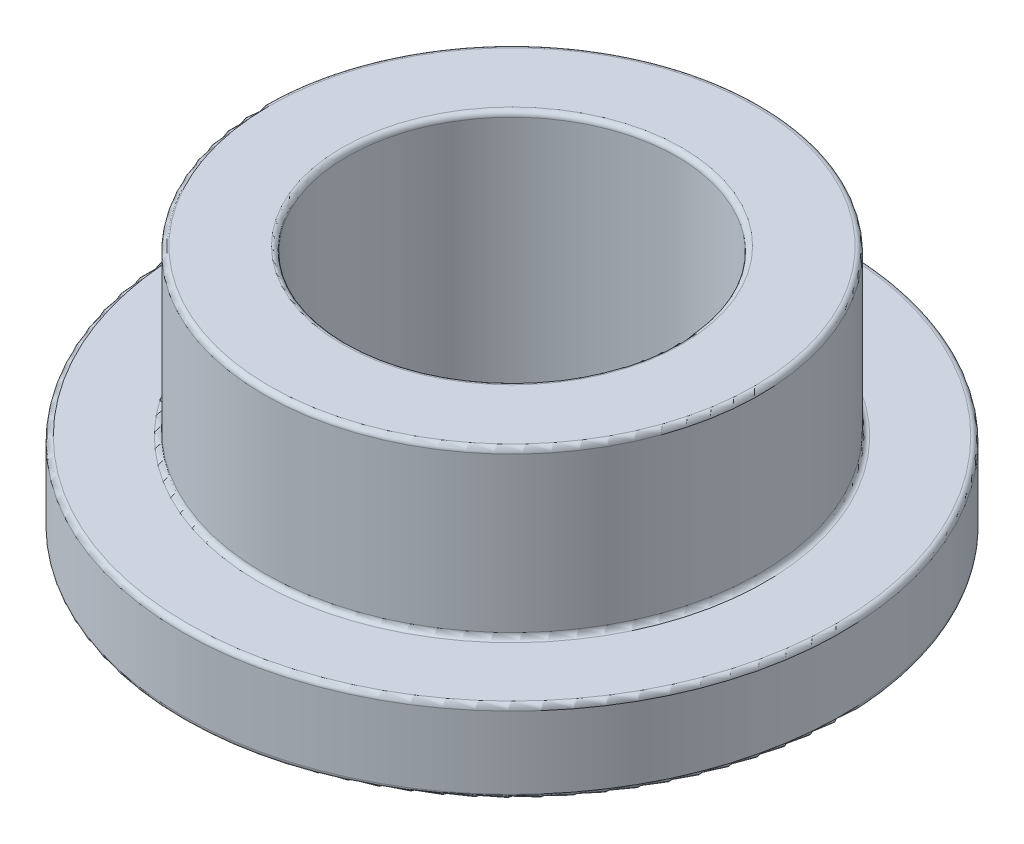
ISO-10303-21;
HEADER;
FILE_DESCRIPTION(('STEP AP214'),'2;1');
FILE_NAME('part.step','',(''),(''),'','','');
FILE_SCHEMA(('AUTOMOTIVE_DESIGN { 1 0 10303 214 1 1 1 1 }'));
ENDSEC;
DATA;
#1=APPLICATION_CONTEXT('core data for automotive mechanical design processes');
#2=APPLICATION_PROTOCOL_DEFINITION('international standard','automotive_design',2000,#1);
#3=PRODUCT_CONTEXT('',#1,'mechanical');
#4=PRODUCT('Part','Part','',(#3));
#5=PRODUCT_RELATED_PRODUCT_CATEGORY('part','',(#4));
#6=PRODUCT_DEFINITION_FORMATION('','',#4);
#7=PRODUCT_DEFINITION_CONTEXT('part definition',#1,'design');
#8=PRODUCT_DEFINITION('design','',#6,#7);
#9=PRODUCT_DEFINITION_SHAPE('','',#8);
#10=(LENGTH_UNIT() NAMED_UNIT(*) SI_UNIT(.MILLI.,.METRE.));
#11=(NAMED_UNIT(*) PLANE_ANGLE_UNIT() SI_UNIT($,.RADIAN.));
#12=(NAMED_UNIT(*) SI_UNIT($,.STERADIAN.) SOLID_ANGLE_UNIT());
#13=UNCERTAINTY_MEASURE_WITH_UNIT(LENGTH_MEASURE(1.E-05),#10,'distance_accuracy_value','');
#14=(GEOMETRIC_REPRESENTATION_CONTEXT(3) GLOBAL_UNCERTAINTY_ASSIGNED_CONTEXT((#13)) GLOBAL_UNIT_ASSIGNED_CONTEXT((#10,
#11,#12)) REPRESENTATION_CONTEXT('',''));
#15=CARTESIAN_POINT('',(0.,0.,0.));
#16=DIRECTION('',(0.,0.,1.));
#17=DIRECTION('',(1.,0.,0.));
#18=AXIS2_PLACEMENT_3D('',#15,#16,#17);
#19=CARTESIAN_POINT('',(0.,6.,0.));
#20=DIRECTION('',(0.,1.,0.));
#21=DIRECTION('',(0.,0.,1.));
#22=AXIS2_PLACEMENT_3D('',#19,#20,#21);
#23=PLANE('',#22);
#24=CARTESIAN_POINT('',(0.,6.,0.));
#25=DIRECTION('',(0.,1.,0.));
#26=DIRECTION('',(0.,0.,1.));
#27=AXIS2_PLACEMENT_3D('',#24,#25,#26);
#28=CIRCLE('',#27,4.13);
#29=CARTESIAN_POINT('',(0.,6.,4.13));
#30=VERTEX_POINT('',#29);
#31=EDGE_CURVE('E10',#30,#30,#28,.F.);
#32=ORIENTED_EDGE('',*,*,#31,.T.);
#33=EDGE_LOOP('',(#32));
#34=FACE_BOUND('',#33,.T.);
#35=CARTESIAN_POINT('',(0.,6.,0.));
#36=DIRECTION('',(0.,1.,0.));
#37=DIRECTION('',(0.,0.,1.));
#38=AXIS2_PLACEMENT_3D('',#35,#36,#37);
#39=CIRCLE('',#38,5.89);
#40=CARTESIAN_POINT('',(0.,6.,5.89));
#41=VERTEX_POINT('',#40);
#42=EDGE_CURVE('E39',#41,#41,#39,.T.);
#43=ORIENTED_EDGE('',*,*,#42,.T.);
#44=EDGE_LOOP('',(#43));
#45=FACE_BOUND('',#44,.T.);
#46=ADVANCED_FACE('F32',(#34,#45),#23,.T.);
#47=CARTESIAN_POINT('',(0.,0.,0.));
#48=DIRECTION('',(0.,1.,0.));
#49=DIRECTION('',(0.,0.,1.));
#50=AXIS2_PLACEMENT_3D('',#47,#48,#49);
#51=PLANE('',#50);
#52=CARTESIAN_POINT('',(0.,0.,0.));
#53=DIRECTION('',(0.,1.,0.));
#54=DIRECTION('',(0.,0.,1.));
#55=AXIS2_PLACEMENT_3D('',#52,#53,#54);
#56=CIRCLE('',#55,4.13);
#57=CARTESIAN_POINT('',(0.,0.,4.13));
#58=VERTEX_POINT('',#57);
#59=EDGE_CURVE('E70',#58,#58,#56,.T.);
#60=ORIENTED_EDGE('',*,*,#59,.T.);
#61=EDGE_LOOP('',(#60));
#62=FACE_BOUND('',#61,.T.);
#63=CARTESIAN_POINT('',(0.,0.,0.));
#64=DIRECTION('',(0.,1.,0.));
#65=DIRECTION('',(0.,0.,1.));
#66=AXIS2_PLACEMENT_3D('',#63,#64,#65);
#67=CIRCLE('',#66,7.875);
#68=CARTESIAN_POINT('',(0.,0.,7.875));
#69=VERTEX_POINT('',#68);
#70=EDGE_CURVE('E73',#69,#69,#67,.F.);
#71=ORIENTED_EDGE('',*,*,#70,.T.);
#72=EDGE_LOOP('',(#71));
#73=FACE_BOUND('',#72,.T.);
#74=ADVANCED_FACE('F77',(#62,#73),#51,.F.);
#75=CARTESIAN_POINT('',(0.,6.,0.));
#76=DIRECTION('',(0.,-1.,0.));
#77=DIRECTION('',(0.,0.,-1.));
#78=AXIS2_PLACEMENT_3D('',#75,#76,#77);
#79=CYLINDRICAL_SURFACE('',#78,6.015);
#80=CARTESIAN_POINT('',(0.,2.125,0.));
#81=DIRECTION('',(0.,1.,0.));
#82=DIRECTION('',(0.,0.,1.));
#83=AXIS2_PLACEMENT_3D('',#80,#81,#82);
#84=CIRCLE('',#83,6.015);
#85=CARTESIAN_POINT('',(0.,2.125,6.015));
#86=VERTEX_POINT('',#85);
#87=EDGE_CURVE('E52',#86,#86,#84,.T.);
#88=ORIENTED_EDGE('',*,*,#87,.T.);
#89=EDGE_LOOP('',(#88));
#90=FACE_BOUND('',#89,.T.);
#91=CARTESIAN_POINT('',(0.,5.875,0.));
#92=DIRECTION('',(0.,1.,0.));
#93=DIRECTION('',(0.,0.,1.));
#94=AXIS2_PLACEMENT_3D('',#91,#92,#93);
#95=CIRCLE('',#94,6.015);
#96=CARTESIAN_POINT('',(0.,5.875,6.015));
#97=VERTEX_POINT('',#96);
#98=EDGE_CURVE('E55',#97,#97,#95,.F.);
#99=ORIENTED_EDGE('',*,*,#98,.T.);
#100=EDGE_LOOP('',(#99));
#101=FACE_BOUND('',#100,.T.);
#102=ADVANCED_FACE('F108',(#90,#101),#79,.T.);
#103=CARTESIAN_POINT('',(0.,6.,0.));
#104=DIRECTION('',(0.,-1.,0.));
#105=DIRECTION('',(0.,0.,-1.));
#106=AXIS2_PLACEMENT_3D('',#103,#104,#105);
#107=CYLINDRICAL_SURFACE('',#106,4.005);
#108=CARTESIAN_POINT('',(0.,0.125,0.));
#109=DIRECTION('',(0.,1.,0.));
#110=DIRECTION('',(0.,0.,1.));
#111=AXIS2_PLACEMENT_3D('',#108,#109,#110);
#112=CIRCLE('',#111,4.005);
#113=CARTESIAN_POINT('',(0.,0.125,4.005));
#114=VERTEX_POINT('',#113);
#115=EDGE_CURVE('E64',#114,#114,#112,.F.);
#116=ORIENTED_EDGE('',*,*,#115,.T.);
#117=EDGE_LOOP('',(#116));
#118=FACE_BOUND('',#117,.T.);
#119=CARTESIAN_POINT('',(0.,5.875,0.));
#120=DIRECTION('',(0.,1.,0.));
#121=DIRECTION('',(0.,0.,1.));
#122=AXIS2_PLACEMENT_3D('',#119,#120,#121);
#123=CIRCLE('',#122,4.005);
#124=CARTESIAN_POINT('',(0.,5.875,4.005));
#125=VERTEX_POINT('',#124);
#126=EDGE_CURVE('E67',#125,#125,#123,.T.);
#127=ORIENTED_EDGE('',*,*,#126,.T.);
#128=EDGE_LOOP('',(#127));
#129=FACE_BOUND('',#128,.T.);
#130=ADVANCED_FACE('F102',(#118,#129),#107,.F.);
#131=CARTESIAN_POINT('',(0.,2.,0.));
#132=DIRECTION('',(0.,1.,0.));
#133=DIRECTION('',(0.,0.,1.));
#134=AXIS2_PLACEMENT_3D('',#131,#132,#133);
#135=PLANE('',#134);
#136=CARTESIAN_POINT('',(0.,2.,0.));
#137=DIRECTION('',(0.,1.,0.));
#138=DIRECTION('',(0.,0.,1.));
#139=AXIS2_PLACEMENT_3D('',#136,#137,#138);
#140=CIRCLE('',#139,6.14);
#141=CARTESIAN_POINT('',(0.,2.,6.14));
#142=VERTEX_POINT('',#141);
#143=EDGE_CURVE('E43',#142,#142,#140,.F.);
#144=ORIENTED_EDGE('',*,*,#143,.T.);
#145=EDGE_LOOP('',(#144));
#146=FACE_BOUND('',#145,.T.);
#147=CARTESIAN_POINT('',(0.,2.,0.));
#148=DIRECTION('',(0.,1.,0.));
#149=DIRECTION('',(0.,0.,1.));
#150=AXIS2_PLACEMENT_3D('',#147,#148,#149);
#151=CIRCLE('',#150,7.875);
#152=CARTESIAN_POINT('',(0.,2.,7.875));
#153=VERTEX_POINT('',#152);
#154=EDGE_CURVE('E47',#153,#153,#151,.T.);
#155=ORIENTED_EDGE('',*,*,#154,.T.);
#156=EDGE_LOOP('',(#155));
#157=FACE_BOUND('',#156,.T.);
#158=ADVANCED_FACE('F90',(#146,#157),#135,.T.);
#159=CARTESIAN_POINT('',(0.,2.,0.));
#160=DIRECTION('',(0.,-1.,0.));
#161=DIRECTION('',(0.,0.,-1.));
#162=AXIS2_PLACEMENT_3D('',#159,#160,#161);
#163=CYLINDRICAL_SURFACE('',#162,8.);
#164=CARTESIAN_POINT('',(0.,0.125,0.));
#165=DIRECTION('',(0.,1.,0.));
#166=DIRECTION('',(0.,0.,1.));
#167=AXIS2_PLACEMENT_3D('',#164,#165,#166);
#168=CIRCLE('',#167,8.);
#169=CARTESIAN_POINT('',(0.,0.125,8.));
#170=VERTEX_POINT('',#169);
#171=EDGE_CURVE('E58',#170,#170,#168,.T.);
#172=ORIENTED_EDGE('',*,*,#171,.T.);
#173=EDGE_LOOP('',(#172));
#174=FACE_BOUND('',#173,.T.);
#175=CARTESIAN_POINT('',(0.,1.875,0.));
#176=DIRECTION('',(0.,1.,0.));
#177=DIRECTION('',(0.,0.,1.));
#178=AXIS2_PLACEMENT_3D('',#175,#176,#177);
#179=CIRCLE('',#178,8.);
#180=CARTESIAN_POINT('',(0.,1.875,8.));
#181=VERTEX_POINT('',#180);
#182=EDGE_CURVE('E61',#181,#181,#179,.F.);
#183=ORIENTED_EDGE('',*,*,#182,.T.);
#184=EDGE_LOOP('',(#183));
#185=FACE_BOUND('',#184,.T.);
#186=ADVANCED_FACE('F87',(#174,#185),#163,.T.);
#187=CARTESIAN_POINT('',(0.,0.125,0.));
#188=DIRECTION('',(0.,1.,0.));
#189=DIRECTION('',(0.,0.,1.));
#190=AXIS2_PLACEMENT_3D('',#187,#188,#189);
#191=TOROIDAL_SURFACE('',#190,4.13,0.125);
#192=ORIENTED_EDGE('',*,*,#115,.F.);
#193=EDGE_LOOP('',(#192));
#194=FACE_BOUND('',#193,.T.);
#195=ORIENTED_EDGE('',*,*,#59,.F.);
#196=EDGE_LOOP('',(#195));
#197=FACE_BOUND('',#196,.T.);
#198=ADVANCED_FACE('F83',(#194,#197),#191,.T.);
#199=CARTESIAN_POINT('',(0.,0.125,0.));
#200=DIRECTION('',(0.,1.,0.));
#201=DIRECTION('',(0.,0.,1.));
#202=AXIS2_PLACEMENT_3D('',#199,#200,#201);
#203=TOROIDAL_SURFACE('',#202,7.875,0.125);
#204=ORIENTED_EDGE('',*,*,#70,.F.);
#205=EDGE_LOOP('',(#204));
#206=FACE_BOUND('',#205,.T.);
#207=ORIENTED_EDGE('',*,*,#171,.F.);
#208=EDGE_LOOP('',(#207));
#209=FACE_BOUND('',#208,.T.);
#210=ADVANCED_FACE('F79',(#206,#209),#203,.T.);
#211=CARTESIAN_POINT('',(0.,2.125,0.));
#212=DIRECTION('',(0.,1.,0.));
#213=DIRECTION('',(0.,0.,1.));
#214=AXIS2_PLACEMENT_3D('',#211,#212,#213);
#215=TOROIDAL_SURFACE('',#214,6.14,0.125);
#216=ORIENTED_EDGE('',*,*,#143,.F.);
#217=EDGE_LOOP('',(#216));
#218=FACE_BOUND('',#217,.T.);
#219=ORIENTED_EDGE('',*,*,#87,.F.);
#220=EDGE_LOOP('',(#219));
#221=FACE_BOUND('',#220,.T.);
#222=ADVANCED_FACE('F82',(#218,#221),#215,.F.);
#223=CARTESIAN_POINT('',(0.,1.875,0.));
#224=DIRECTION('',(0.,1.,0.));
#225=DIRECTION('',(0.,0.,1.));
#226=AXIS2_PLACEMENT_3D('',#223,#224,#225);
#227=TOROIDAL_SURFACE('',#226,7.875,0.125);
#228=ORIENTED_EDGE('',*,*,#182,.F.);
#229=EDGE_LOOP('',(#228));
#230=FACE_BOUND('',#229,.T.);
#231=ORIENTED_EDGE('',*,*,#154,.F.);
#232=EDGE_LOOP('',(#231));
#233=FACE_BOUND('',#232,.T.);
#234=ADVANCED_FACE('F94',(#230,#233),#227,.T.);
#235=CARTESIAN_POINT('',(0.,5.875,0.));
#236=DIRECTION('',(0.,1.,0.));
#237=DIRECTION('',(0.,0.,1.));
#238=AXIS2_PLACEMENT_3D('',#235,#236,#237);
#239=TOROIDAL_SURFACE('',#238,4.13,0.125);
#240=ORIENTED_EDGE('',*,*,#31,.F.);
#241=EDGE_LOOP('',(#240));
#242=FACE_BOUND('',#241,.T.);
#243=ORIENTED_EDGE('',*,*,#126,.F.);
#244=EDGE_LOOP('',(#243));
#245=FACE_BOUND('',#244,.T.);
#246=ADVANCED_FACE('F97',(#242,#245),#239,.T.);
#247=CARTESIAN_POINT('',(0.,5.875,0.));
#248=DIRECTION('',(0.,1.,0.));
#249=DIRECTION('',(0.,0.,1.));
#250=AXIS2_PLACEMENT_3D('',#247,#248,#249);
#251=TOROIDAL_SURFACE('',#250,5.89,0.125);
#252=ORIENTED_EDGE('',*,*,#98,.F.);
#253=EDGE_LOOP('',(#252));
#254=FACE_BOUND('',#253,.T.);
#255=ORIENTED_EDGE('',*,*,#42,.F.);
#256=EDGE_LOOP('',(#255));
#257=FACE_BOUND('',#256,.T.);
#258=ADVANCED_FACE('F34',(#254,#257),#251,.T.);
#259=CLOSED_SHELL('',(#46,#74,#102,#130,#158,#186,#198,#210,#222,#234,#246,#258));
#260=MANIFOLD_SOLID_BREP('B2',#259);
#261=ADVANCED_BREP_SHAPE_REPRESENTATION('',(#18,#260),#14);
#262=SHAPE_DEFINITION_REPRESENTATION(#9,#261);
ENDSEC;
END-ISO-10303-21;
